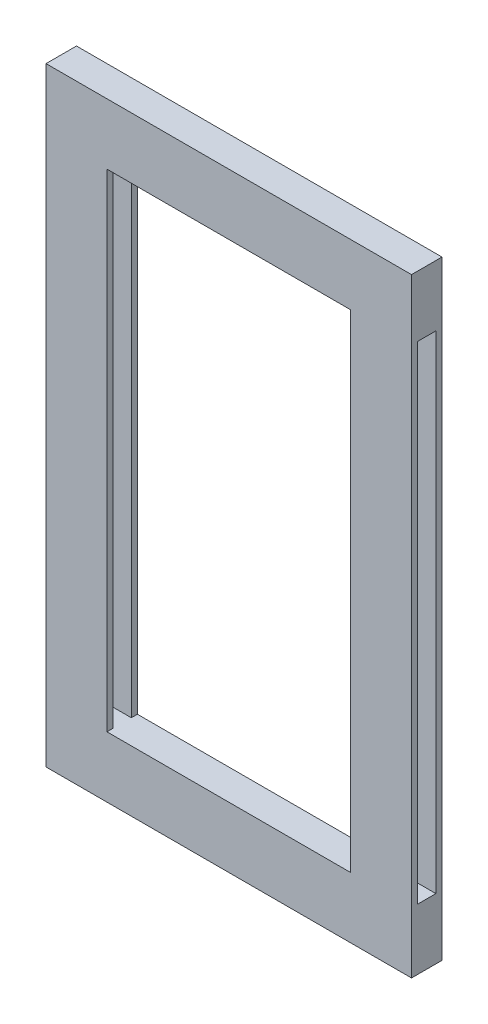
ISO-10303-21;
HEADER;
FILE_DESCRIPTION(('STEP AP214'),'2;1');
FILE_NAME('part.step','',(''),(''),'','','');
FILE_SCHEMA(('AUTOMOTIVE_DESIGN { 1 0 10303 214 1 1 1 1 }'));
ENDSEC;
DATA;
#1=APPLICATION_CONTEXT('core data for automotive mechanical design processes');
#2=APPLICATION_PROTOCOL_DEFINITION('international standard','automotive_design',2000,#1);
#3=PRODUCT_CONTEXT('',#1,'mechanical');
#4=PRODUCT('Part','Part','',(#3));
#5=PRODUCT_RELATED_PRODUCT_CATEGORY('part','',(#4));
#6=PRODUCT_DEFINITION_FORMATION('','',#4);
#7=PRODUCT_DEFINITION_CONTEXT('part definition',#1,'design');
#8=PRODUCT_DEFINITION('design','',#6,#7);
#9=PRODUCT_DEFINITION_SHAPE('','',#8);
#10=(LENGTH_UNIT() NAMED_UNIT(*) SI_UNIT(.MILLI.,.METRE.));
#11=(NAMED_UNIT(*) PLANE_ANGLE_UNIT() SI_UNIT($,.RADIAN.));
#12=(NAMED_UNIT(*) SI_UNIT($,.STERADIAN.) SOLID_ANGLE_UNIT());
#13=UNCERTAINTY_MEASURE_WITH_UNIT(LENGTH_MEASURE(1.E-05),#10,'distance_accuracy_value','');
#14=(GEOMETRIC_REPRESENTATION_CONTEXT(3) GLOBAL_UNCERTAINTY_ASSIGNED_CONTEXT((#13)) GLOBAL_UNIT_ASSIGNED_CONTEXT((#10,
#11,#12)) REPRESENTATION_CONTEXT('',''));
#15=CARTESIAN_POINT('',(0.,0.,0.));
#16=DIRECTION('',(0.,0.,1.));
#17=DIRECTION('',(1.,0.,0.));
#18=AXIS2_PLACEMENT_3D('',#15,#16,#17);
#19=CARTESIAN_POINT('',(0.,9.99999999999999,4.));
#20=DIRECTION('',(0.,0.,1.));
#21=DIRECTION('',(1.,0.,0.));
#22=AXIS2_PLACEMENT_3D('',#19,#20,#21);
#23=PLANE('',#22);
#24=DIRECTION('',(-1.,0.,0.));
#25=VECTOR('',#24,1.);
#26=CARTESIAN_POINT('',(0.,9.99999999999999,4.));
#27=LINE('',#26,#25);
#28=CARTESIAN_POINT('',(0.,9.99999999999999,4.));
#29=VERTEX_POINT('',#28);
#30=CARTESIAN_POINT('',(-9.99999999999998,9.99999999999999,4.));
#31=VERTEX_POINT('',#30);
#32=EDGE_CURVE('E254',#29,#31,#27,.T.);
#33=ORIENTED_EDGE('',*,*,#32,.T.);
#34=DIRECTION('',(0.,1.,0.));
#35=VECTOR('',#34,1.);
#36=CARTESIAN_POINT('',(-9.99999999999999,9.99999999999999,4.));
#37=LINE('',#36,#35);
#38=CARTESIAN_POINT('',(-9.99999999999999,90.,4.));
#39=VERTEX_POINT('',#38);
#40=EDGE_CURVE('E208',#31,#39,#37,.T.);
#41=ORIENTED_EDGE('',*,*,#40,.T.);
#42=DIRECTION('',(-1.,0.,0.));
#43=VECTOR('',#42,1.);
#44=CARTESIAN_POINT('',(0.,90.,4.));
#45=LINE('',#44,#43);
#46=CARTESIAN_POINT('',(0.,90.,4.));
#47=VERTEX_POINT('',#46);
#48=EDGE_CURVE('E269',#47,#39,#45,.T.);
#49=ORIENTED_EDGE('',*,*,#48,.F.);
#50=DIRECTION('',(0.,1.,0.));
#51=VECTOR('',#50,1.);
#52=CARTESIAN_POINT('',(0.,9.99999999999999,4.));
#53=LINE('',#52,#51);
#54=EDGE_CURVE('E222',#29,#47,#53,.T.);
#55=ORIENTED_EDGE('',*,*,#54,.F.);
#56=EDGE_LOOP('',(#33,#41,#49,#55));
#57=FACE_BOUND('',#56,.T.);
#58=ADVANCED_FACE('F41',(#57),#23,.F.);
#59=CARTESIAN_POINT('',(0.,9.99999999999999,1.));
#60=DIRECTION('',(0.,0.,-1.));
#61=DIRECTION('',(-1.,0.,0.));
#62=AXIS2_PLACEMENT_3D('',#59,#60,#61);
#63=PLANE('',#62);
#64=DIRECTION('',(-1.,0.,0.));
#65=VECTOR('',#64,1.);
#66=CARTESIAN_POINT('',(0.,90.,1.));
#67=LINE('',#66,#65);
#68=CARTESIAN_POINT('',(0.,90.,1.));
#69=VERTEX_POINT('',#68);
#70=CARTESIAN_POINT('',(-9.99999999999999,90.,1.));
#71=VERTEX_POINT('',#70);
#72=EDGE_CURVE('E264',#69,#71,#67,.T.);
#73=ORIENTED_EDGE('',*,*,#72,.T.);
#74=DIRECTION('',(0.,-1.,0.));
#75=VECTOR('',#74,1.);
#76=CARTESIAN_POINT('',(-9.99999999999999,9.99999999999999,1.));
#77=LINE('',#76,#75);
#78=CARTESIAN_POINT('',(-9.99999999999999,10.,1.));
#79=VERTEX_POINT('',#78);
#80=EDGE_CURVE('E204',#71,#79,#77,.T.);
#81=ORIENTED_EDGE('',*,*,#80,.T.);
#82=DIRECTION('',(-1.,0.,0.));
#83=VECTOR('',#82,1.);
#84=CARTESIAN_POINT('',(0.,9.99999999999999,1.));
#85=LINE('',#84,#83);
#86=CARTESIAN_POINT('',(0.,9.99999999999999,1.));
#87=VERTEX_POINT('',#86);
#88=EDGE_CURVE('E260',#87,#79,#85,.T.);
#89=ORIENTED_EDGE('',*,*,#88,.F.);
#90=DIRECTION('',(0.,-1.,0.));
#91=VECTOR('',#90,1.);
#92=CARTESIAN_POINT('',(0.,9.99999999999999,1.));
#93=LINE('',#92,#91);
#94=EDGE_CURVE('E231',#69,#87,#93,.T.);
#95=ORIENTED_EDGE('',*,*,#94,.F.);
#96=EDGE_LOOP('',(#73,#81,#89,#95));
#97=FACE_BOUND('',#96,.T.);
#98=ADVANCED_FACE('F333',(#97),#63,.F.);
#99=CARTESIAN_POINT('',(0.,0.,5.));
#100=DIRECTION('',(-1.,0.,0.));
#101=DIRECTION('',(0.,0.,1.));
#102=AXIS2_PLACEMENT_3D('',#99,#100,#101);
#103=PLANE('',#102);
#104=DIRECTION('',(0.,0.,1.));
#105=VECTOR('',#104,1.);
#106=CARTESIAN_POINT('',(0.,9.99999999999999,1.));
#107=LINE('',#106,#105);
#108=EDGE_CURVE('E235',#87,#29,#107,.T.);
#109=ORIENTED_EDGE('',*,*,#108,.T.);
#110=ORIENTED_EDGE('',*,*,#54,.T.);
#111=DIRECTION('',(0.,0.,-1.));
#112=VECTOR('',#111,1.);
#113=CARTESIAN_POINT('',(0.,90.,1.));
#114=LINE('',#113,#112);
#115=EDGE_CURVE('E226',#47,#69,#114,.T.);
#116=ORIENTED_EDGE('',*,*,#115,.T.);
#117=ORIENTED_EDGE('',*,*,#94,.T.);
#118=EDGE_LOOP('',(#109,#110,#116,#117));
#119=FACE_BOUND('',#118,.T.);
#120=DIRECTION('',(0.,1.,0.));
#121=VECTOR('',#120,1.);
#122=CARTESIAN_POINT('',(0.,0.,0.));
#123=LINE('',#122,#121);
#124=CARTESIAN_POINT('',(0.,0.,0.));
#125=VERTEX_POINT('',#124);
#126=CARTESIAN_POINT('',(0.,100.,0.));
#127=VERTEX_POINT('',#126);
#128=EDGE_CURVE('E258',#125,#127,#123,.T.);
#129=ORIENTED_EDGE('',*,*,#128,.T.);
#130=DIRECTION('',(0.,0.,-1.));
#131=VECTOR('',#130,1.);
#132=CARTESIAN_POINT('',(0.,100.,5.));
#133=LINE('',#132,#131);
#134=CARTESIAN_POINT('',(0.,100.,5.));
#135=VERTEX_POINT('',#134);
#136=EDGE_CURVE('E11',#135,#127,#133,.T.);
#137=ORIENTED_EDGE('',*,*,#136,.F.);
#138=DIRECTION('',(0.,1.,0.));
#139=VECTOR('',#138,1.);
#140=CARTESIAN_POINT('',(0.,0.,5.));
#141=LINE('',#140,#139);
#142=CARTESIAN_POINT('',(0.,0.,5.));
#143=VERTEX_POINT('',#142);
#144=EDGE_CURVE('E273',#143,#135,#141,.T.);
#145=ORIENTED_EDGE('',*,*,#144,.F.);
#146=DIRECTION('',(0.,0.,-1.));
#147=VECTOR('',#146,1.);
#148=CARTESIAN_POINT('',(0.,0.,5.));
#149=LINE('',#148,#147);
#150=EDGE_CURVE('E287',#143,#125,#149,.T.);
#151=ORIENTED_EDGE('',*,*,#150,.T.);
#152=EDGE_LOOP('',(#129,#137,#145,#151));
#153=FACE_BOUND('',#152,.T.);
#154=ADVANCED_FACE('F43',(#119,#153),#103,.F.);
#155=CARTESIAN_POINT('',(0.,100.,5.));
#156=DIRECTION('',(0.,-1.,0.));
#157=DIRECTION('',(1.,0.,0.));
#158=AXIS2_PLACEMENT_3D('',#155,#156,#157);
#159=PLANE('',#158);
#160=DIRECTION('',(-1.,0.,0.));
#161=VECTOR('',#160,1.);
#162=CARTESIAN_POINT('',(0.,100.,0.));
#163=LINE('',#162,#161);
#164=CARTESIAN_POINT('',(-60.,100.,0.));
#165=VERTEX_POINT('',#164);
#166=EDGE_CURVE('E291',#127,#165,#163,.T.);
#167=ORIENTED_EDGE('',*,*,#166,.T.);
#168=DIRECTION('',(0.,0.,-1.));
#169=VECTOR('',#168,1.);
#170=CARTESIAN_POINT('',(-60.,100.,5.));
#171=LINE('',#170,#169);
#172=CARTESIAN_POINT('',(-60.,100.,5.));
#173=VERTEX_POINT('',#172);
#174=EDGE_CURVE('E50',#173,#165,#171,.T.);
#175=ORIENTED_EDGE('',*,*,#174,.F.);
#176=DIRECTION('',(-1.,0.,0.));
#177=VECTOR('',#176,1.);
#178=CARTESIAN_POINT('',(0.,100.,5.));
#179=LINE('',#178,#177);
#180=EDGE_CURVE('E277',#135,#173,#179,.T.);
#181=ORIENTED_EDGE('',*,*,#180,.F.);
#182=ORIENTED_EDGE('',*,*,#136,.T.);
#183=EDGE_LOOP('',(#167,#175,#181,#182));
#184=FACE_BOUND('',#183,.T.);
#185=ADVANCED_FACE('F325',(#184),#159,.F.);
#186=CARTESIAN_POINT('',(-60.,0.,5.));
#187=DIRECTION('',(1.,0.,0.));
#188=DIRECTION('',(0.,0.,-1.));
#189=AXIS2_PLACEMENT_3D('',#186,#187,#188);
#190=PLANE('',#189);
#191=DIRECTION('',(0.,0.,-1.));
#192=VECTOR('',#191,1.);
#193=CARTESIAN_POINT('',(-60.,90.,1.));
#194=LINE('',#193,#192);
#195=CARTESIAN_POINT('',(-60.,90.,4.));
#196=VERTEX_POINT('',#195);
#197=CARTESIAN_POINT('',(-60.,90.,1.));
#198=VERTEX_POINT('',#197);
#199=EDGE_CURVE('E243',#196,#198,#194,.T.);
#200=ORIENTED_EDGE('',*,*,#199,.F.);
#201=DIRECTION('',(0.,1.,0.));
#202=VECTOR('',#201,1.);
#203=CARTESIAN_POINT('',(-60.,9.99999999999999,4.));
#204=LINE('',#203,#202);
#205=CARTESIAN_POINT('',(-60.,9.99999999999999,4.));
#206=VERTEX_POINT('',#205);
#207=EDGE_CURVE('E221',#206,#196,#204,.T.);
#208=ORIENTED_EDGE('',*,*,#207,.F.);
#209=DIRECTION('',(0.,0.,1.));
#210=VECTOR('',#209,1.);
#211=CARTESIAN_POINT('',(-60.,9.99999999999999,1.));
#212=LINE('',#211,#210);
#213=CARTESIAN_POINT('',(-60.,9.99999999999999,1.));
#214=VERTEX_POINT('',#213);
#215=EDGE_CURVE('E227',#214,#206,#212,.T.);
#216=ORIENTED_EDGE('',*,*,#215,.F.);
#217=DIRECTION('',(0.,-1.,0.));
#218=VECTOR('',#217,1.);
#219=CARTESIAN_POINT('',(-60.,9.99999999999999,1.));
#220=LINE('',#219,#218);
#221=EDGE_CURVE('E247',#198,#214,#220,.T.);
#222=ORIENTED_EDGE('',*,*,#221,.F.);
#223=EDGE_LOOP('',(#200,#208,#216,#222));
#224=FACE_BOUND('',#223,.T.);
#225=DIRECTION('',(0.,-1.,0.));
#226=VECTOR('',#225,1.);
#227=CARTESIAN_POINT('',(-60.,0.,0.));
#228=LINE('',#227,#226);
#229=CARTESIAN_POINT('',(-60.,0.,0.));
#230=VERTEX_POINT('',#229);
#231=EDGE_CURVE('E294',#165,#230,#228,.T.);
#232=ORIENTED_EDGE('',*,*,#231,.T.);
#233=DIRECTION('',(0.,0.,-1.));
#234=VECTOR('',#233,1.);
#235=CARTESIAN_POINT('',(-60.,0.,5.));
#236=LINE('',#235,#234);
#237=CARTESIAN_POINT('',(-60.,0.,5.));
#238=VERTEX_POINT('',#237);
#239=EDGE_CURVE('E302',#238,#230,#236,.T.);
#240=ORIENTED_EDGE('',*,*,#239,.F.);
#241=DIRECTION('',(0.,-1.,0.));
#242=VECTOR('',#241,1.);
#243=CARTESIAN_POINT('',(-60.,0.,5.));
#244=LINE('',#243,#242);
#245=EDGE_CURVE('E281',#173,#238,#244,.T.);
#246=ORIENTED_EDGE('',*,*,#245,.F.);
#247=ORIENTED_EDGE('',*,*,#174,.T.);
#248=EDGE_LOOP('',(#232,#240,#246,#247));
#249=FACE_BOUND('',#248,.T.);
#250=ADVANCED_FACE('F311',(#224,#249),#190,.F.);
#251=CARTESIAN_POINT('',(0.,0.,5.));
#252=DIRECTION('',(0.,1.,0.));
#253=DIRECTION('',(0.,0.,1.));
#254=AXIS2_PLACEMENT_3D('',#251,#252,#253);
#255=PLANE('',#254);
#256=DIRECTION('',(1.,0.,0.));
#257=VECTOR('',#256,1.);
#258=CARTESIAN_POINT('',(0.,0.,0.));
#259=LINE('',#258,#257);
#260=EDGE_CURVE('E278',#230,#125,#259,.T.);
#261=ORIENTED_EDGE('',*,*,#260,.T.);
#262=ORIENTED_EDGE('',*,*,#150,.F.);
#263=DIRECTION('',(1.,0.,0.));
#264=VECTOR('',#263,1.);
#265=CARTESIAN_POINT('',(0.,0.,5.));
#266=LINE('',#265,#264);
#267=EDGE_CURVE('E284',#238,#143,#266,.T.);
#268=ORIENTED_EDGE('',*,*,#267,.F.);
#269=ORIENTED_EDGE('',*,*,#239,.T.);
#270=EDGE_LOOP('',(#261,#262,#268,#269));
#271=FACE_BOUND('',#270,.T.);
#272=ADVANCED_FACE('F318',(#271),#255,.F.);
#273=CARTESIAN_POINT('',(0.,0.,5.));
#274=DIRECTION('',(0.,0.,1.));
#275=DIRECTION('',(1.,0.,0.));
#276=AXIS2_PLACEMENT_3D('',#273,#274,#275);
#277=PLANE('',#276);
#278=DIRECTION('',(0.,1.,0.));
#279=VECTOR('',#278,1.);
#280=CARTESIAN_POINT('',(-9.99999999999999,0.,5.));
#281=LINE('',#280,#279);
#282=CARTESIAN_POINT('',(-9.99999999999999,10.,5.));
#283=VERTEX_POINT('',#282);
#284=CARTESIAN_POINT('',(-9.99999999999999,90.,5.));
#285=VERTEX_POINT('',#284);
#286=EDGE_CURVE('E212',#283,#285,#281,.T.);
#287=ORIENTED_EDGE('',*,*,#286,.F.);
#288=DIRECTION('',(1.,0.,0.));
#289=VECTOR('',#288,1.);
#290=CARTESIAN_POINT('',(0.,10.,5.));
#291=LINE('',#290,#289);
#292=CARTESIAN_POINT('',(-50.,10.,5.));
#293=VERTEX_POINT('',#292);
#294=EDGE_CURVE('E215',#293,#283,#291,.T.);
#295=ORIENTED_EDGE('',*,*,#294,.F.);
#296=DIRECTION('',(0.,-1.,0.));
#297=VECTOR('',#296,1.);
#298=CARTESIAN_POINT('',(-50.,0.,5.));
#299=LINE('',#298,#297);
#300=CARTESIAN_POINT('',(-50.,90.,5.));
#301=VERTEX_POINT('',#300);
#302=EDGE_CURVE('E201',#301,#293,#299,.T.);
#303=ORIENTED_EDGE('',*,*,#302,.F.);
#304=DIRECTION('',(-1.,0.,0.));
#305=VECTOR('',#304,1.);
#306=CARTESIAN_POINT('',(0.,90.,5.));
#307=LINE('',#306,#305);
#308=EDGE_CURVE('E218',#285,#301,#307,.T.);
#309=ORIENTED_EDGE('',*,*,#308,.F.);
#310=EDGE_LOOP('',(#287,#295,#303,#309));
#311=FACE_BOUND('',#310,.T.);
#312=ORIENTED_EDGE('',*,*,#144,.T.);
#313=ORIENTED_EDGE('',*,*,#180,.T.);
#314=ORIENTED_EDGE('',*,*,#245,.T.);
#315=ORIENTED_EDGE('',*,*,#267,.T.);
#316=EDGE_LOOP('',(#312,#313,#314,#315));
#317=FACE_BOUND('',#316,.T.);
#318=ADVANCED_FACE('F324',(#311,#317),#277,.T.);
#319=CARTESIAN_POINT('',(0.,0.,0.));
#320=DIRECTION('',(0.,0.,1.));
#321=DIRECTION('',(1.,0.,0.));
#322=AXIS2_PLACEMENT_3D('',#319,#320,#321);
#323=PLANE('',#322);
#324=DIRECTION('',(-1.,0.,0.));
#325=VECTOR('',#324,1.);
#326=CARTESIAN_POINT('',(-50.,10.,0.));
#327=LINE('',#326,#325);
#328=CARTESIAN_POINT('',(-9.99999999999999,10.,0.));
#329=VERTEX_POINT('',#328);
#330=CARTESIAN_POINT('',(-50.,10.,0.));
#331=VERTEX_POINT('',#330);
#332=EDGE_CURVE('E168',#329,#331,#327,.T.);
#333=ORIENTED_EDGE('',*,*,#332,.F.);
#334=DIRECTION('',(0.,-1.,0.));
#335=VECTOR('',#334,1.);
#336=CARTESIAN_POINT('',(-9.99999999999999,10.,0.));
#337=LINE('',#336,#335);
#338=CARTESIAN_POINT('',(-9.99999999999999,90.,0.));
#339=VERTEX_POINT('',#338);
#340=EDGE_CURVE('E65',#339,#329,#337,.T.);
#341=ORIENTED_EDGE('',*,*,#340,.F.);
#342=DIRECTION('',(1.,0.,0.));
#343=VECTOR('',#342,1.);
#344=CARTESIAN_POINT('',(-50.,90.,0.));
#345=LINE('',#344,#343);
#346=CARTESIAN_POINT('',(-50.,90.,0.));
#347=VERTEX_POINT('',#346);
#348=EDGE_CURVE('E178',#347,#339,#345,.T.);
#349=ORIENTED_EDGE('',*,*,#348,.F.);
#350=DIRECTION('',(0.,1.,0.));
#351=VECTOR('',#350,1.);
#352=CARTESIAN_POINT('',(-50.,10.,0.));
#353=LINE('',#352,#351);
#354=EDGE_CURVE('E159',#331,#347,#353,.T.);
#355=ORIENTED_EDGE('',*,*,#354,.F.);
#356=EDGE_LOOP('',(#333,#341,#349,#355));
#357=FACE_BOUND('',#356,.T.);
#358=ORIENTED_EDGE('',*,*,#128,.F.);
#359=ORIENTED_EDGE('',*,*,#260,.F.);
#360=ORIENTED_EDGE('',*,*,#231,.F.);
#361=ORIENTED_EDGE('',*,*,#166,.F.);
#362=EDGE_LOOP('',(#358,#359,#360,#361));
#363=FACE_BOUND('',#362,.T.);
#364=ADVANCED_FACE('F175',(#357,#363),#323,.F.);
#365=CARTESIAN_POINT('',(-50.,90.,4.));
#366=VERTEX_POINT('',#365);
#367=EDGE_CURVE('E239',#366,#196,#45,.T.);
#368=ORIENTED_EDGE('',*,*,#367,.F.);
#369=DIRECTION('',(0.,-1.,0.));
#370=VECTOR('',#369,1.);
#371=CARTESIAN_POINT('',(-50.,9.99999999999999,4.));
#372=LINE('',#371,#370);
#373=CARTESIAN_POINT('',(-50.,10.,4.));
#374=VERTEX_POINT('',#373);
#375=EDGE_CURVE('E197',#366,#374,#372,.T.);
#376=ORIENTED_EDGE('',*,*,#375,.T.);
#377=EDGE_CURVE('E259',#374,#206,#27,.T.);
#378=ORIENTED_EDGE('',*,*,#377,.T.);
#379=ORIENTED_EDGE('',*,*,#207,.T.);
#380=EDGE_LOOP('',(#368,#376,#378,#379));
#381=FACE_BOUND('',#380,.T.);
#382=ADVANCED_FACE('F338',(#381),#23,.F.);
#383=CARTESIAN_POINT('',(0.,9.99999999999999,1.));
#384=DIRECTION('',(0.,-1.,0.));
#385=DIRECTION('',(0.,0.,-1.));
#386=AXIS2_PLACEMENT_3D('',#383,#384,#385);
#387=PLANE('',#386);
#388=ORIENTED_EDGE('',*,*,#377,.F.);
#389=DIRECTION('',(0.,0.,-1.));
#390=VECTOR('',#389,1.);
#391=CARTESIAN_POINT('',(-50.,10.,28.));
#392=LINE('',#391,#390);
#393=EDGE_CURVE('E57',#293,#374,#392,.T.);
#394=ORIENTED_EDGE('',*,*,#393,.F.);
#395=ORIENTED_EDGE('',*,*,#294,.T.);
#396=DIRECTION('',(0.,0.,-1.));
#397=VECTOR('',#396,1.);
#398=CARTESIAN_POINT('',(-9.99999999999999,10.,28.));
#399=LINE('',#398,#397);
#400=EDGE_CURVE('E165',#283,#31,#399,.T.);
#401=ORIENTED_EDGE('',*,*,#400,.T.);
#402=ORIENTED_EDGE('',*,*,#32,.F.);
#403=ORIENTED_EDGE('',*,*,#108,.F.);
#404=ORIENTED_EDGE('',*,*,#88,.T.);
#405=EDGE_CURVE('E171',#79,#329,#399,.T.);
#406=ORIENTED_EDGE('',*,*,#405,.T.);
#407=ORIENTED_EDGE('',*,*,#332,.T.);
#408=CARTESIAN_POINT('',(-50.,9.99999999999999,1.));
#409=VERTEX_POINT('',#408);
#410=EDGE_CURVE('E155',#409,#331,#392,.T.);
#411=ORIENTED_EDGE('',*,*,#410,.F.);
#412=EDGE_CURVE('E263',#409,#214,#85,.T.);
#413=ORIENTED_EDGE('',*,*,#412,.T.);
#414=ORIENTED_EDGE('',*,*,#215,.T.);
#415=EDGE_LOOP('',(#388,#394,#395,#401,#402,#403,#404,#406,#407,#411,#413,#414));
#416=FACE_BOUND('',#415,.T.);
#417=ADVANCED_FACE('F169',(#416),#387,.F.);
#418=ORIENTED_EDGE('',*,*,#412,.F.);
#419=DIRECTION('',(0.,1.,0.));
#420=VECTOR('',#419,1.);
#421=CARTESIAN_POINT('',(-50.,9.99999999999999,1.));
#422=LINE('',#421,#420);
#423=CARTESIAN_POINT('',(-50.,90.,1.));
#424=VERTEX_POINT('',#423);
#425=EDGE_CURVE('E162',#409,#424,#422,.T.);
#426=ORIENTED_EDGE('',*,*,#425,.T.);
#427=EDGE_CURVE('E268',#424,#198,#67,.T.);
#428=ORIENTED_EDGE('',*,*,#427,.T.);
#429=ORIENTED_EDGE('',*,*,#221,.T.);
#430=EDGE_LOOP('',(#418,#426,#428,#429));
#431=FACE_BOUND('',#430,.T.);
#432=ADVANCED_FACE('F344',(#431),#63,.F.);
#433=CARTESIAN_POINT('',(0.,90.,1.));
#434=DIRECTION('',(0.,1.,0.));
#435=DIRECTION('',(0.,0.,1.));
#436=AXIS2_PLACEMENT_3D('',#433,#434,#435);
#437=PLANE('',#436);
#438=ORIENTED_EDGE('',*,*,#427,.F.);
#439=DIRECTION('',(0.,0.,-1.));
#440=VECTOR('',#439,1.);
#441=CARTESIAN_POINT('',(-50.,90.,28.));
#442=LINE('',#441,#440);
#443=EDGE_CURVE('E190',#424,#347,#442,.T.);
#444=ORIENTED_EDGE('',*,*,#443,.T.);
#445=ORIENTED_EDGE('',*,*,#348,.T.);
#446=DIRECTION('',(0.,0.,-1.));
#447=VECTOR('',#446,1.);
#448=CARTESIAN_POINT('',(-9.99999999999999,90.,28.));
#449=LINE('',#448,#447);
#450=EDGE_CURVE('E185',#71,#339,#449,.T.);
#451=ORIENTED_EDGE('',*,*,#450,.F.);
#452=ORIENTED_EDGE('',*,*,#72,.F.);
#453=ORIENTED_EDGE('',*,*,#115,.F.);
#454=ORIENTED_EDGE('',*,*,#48,.T.);
#455=EDGE_CURVE('E188',#285,#39,#449,.T.);
#456=ORIENTED_EDGE('',*,*,#455,.F.);
#457=ORIENTED_EDGE('',*,*,#308,.T.);
#458=EDGE_CURVE('E189',#301,#366,#442,.T.);
#459=ORIENTED_EDGE('',*,*,#458,.T.);
#460=ORIENTED_EDGE('',*,*,#367,.T.);
#461=ORIENTED_EDGE('',*,*,#199,.T.);
#462=EDGE_LOOP('',(#438,#444,#445,#451,#452,#453,#454,#456,#457,#459,#460,#461));
#463=FACE_BOUND('',#462,.T.);
#464=ADVANCED_FACE('F380',(#463),#437,.F.);
#465=CARTESIAN_POINT('',(-50.,10.,28.));
#466=DIRECTION('',(-1.,0.,0.));
#467=DIRECTION('',(0.,0.,1.));
#468=AXIS2_PLACEMENT_3D('',#465,#466,#467);
#469=PLANE('',#468);
#470=ORIENTED_EDGE('',*,*,#410,.T.);
#471=ORIENTED_EDGE('',*,*,#354,.T.);
#472=ORIENTED_EDGE('',*,*,#443,.F.);
#473=ORIENTED_EDGE('',*,*,#425,.F.);
#474=EDGE_LOOP('',(#470,#471,#472,#473));
#475=FACE_BOUND('',#474,.T.);
#476=ADVANCED_FACE('F157',(#475),#469,.F.);
#477=CARTESIAN_POINT('',(-9.99999999999999,10.,28.));
#478=DIRECTION('',(1.,0.,0.));
#479=DIRECTION('',(0.,0.,-1.));
#480=AXIS2_PLACEMENT_3D('',#477,#478,#479);
#481=PLANE('',#480);
#482=ORIENTED_EDGE('',*,*,#450,.T.);
#483=ORIENTED_EDGE('',*,*,#340,.T.);
#484=ORIENTED_EDGE('',*,*,#405,.F.);
#485=ORIENTED_EDGE('',*,*,#80,.F.);
#486=EDGE_LOOP('',(#482,#483,#484,#485));
#487=FACE_BOUND('',#486,.T.);
#488=ADVANCED_FACE('F378',(#487),#481,.F.);
#489=ORIENTED_EDGE('',*,*,#286,.T.);
#490=ORIENTED_EDGE('',*,*,#455,.T.);
#491=ORIENTED_EDGE('',*,*,#40,.F.);
#492=ORIENTED_EDGE('',*,*,#400,.F.);
#493=EDGE_LOOP('',(#489,#490,#491,#492));
#494=FACE_BOUND('',#493,.T.);
#495=ADVANCED_FACE('F373',(#494),#481,.F.);
#496=ORIENTED_EDGE('',*,*,#302,.T.);
#497=ORIENTED_EDGE('',*,*,#393,.T.);
#498=ORIENTED_EDGE('',*,*,#375,.F.);
#499=ORIENTED_EDGE('',*,*,#458,.F.);
#500=EDGE_LOOP('',(#496,#497,#498,#499));
#501=FACE_BOUND('',#500,.T.);
#502=ADVANCED_FACE('F394',(#501),#469,.F.);
#503=CLOSED_SHELL('',(#58,#98,#154,#185,#250,#272,#318,#364,#382,#417,#432,#464,#476,#488,#495,#502));
#504=MANIFOLD_SOLID_BREP('B2',#503);
#505=ADVANCED_BREP_SHAPE_REPRESENTATION('',(#18,#504),#14);
#506=SHAPE_DEFINITION_REPRESENTATION(#9,#505);
ENDSEC;
END-ISO-10303-21;
